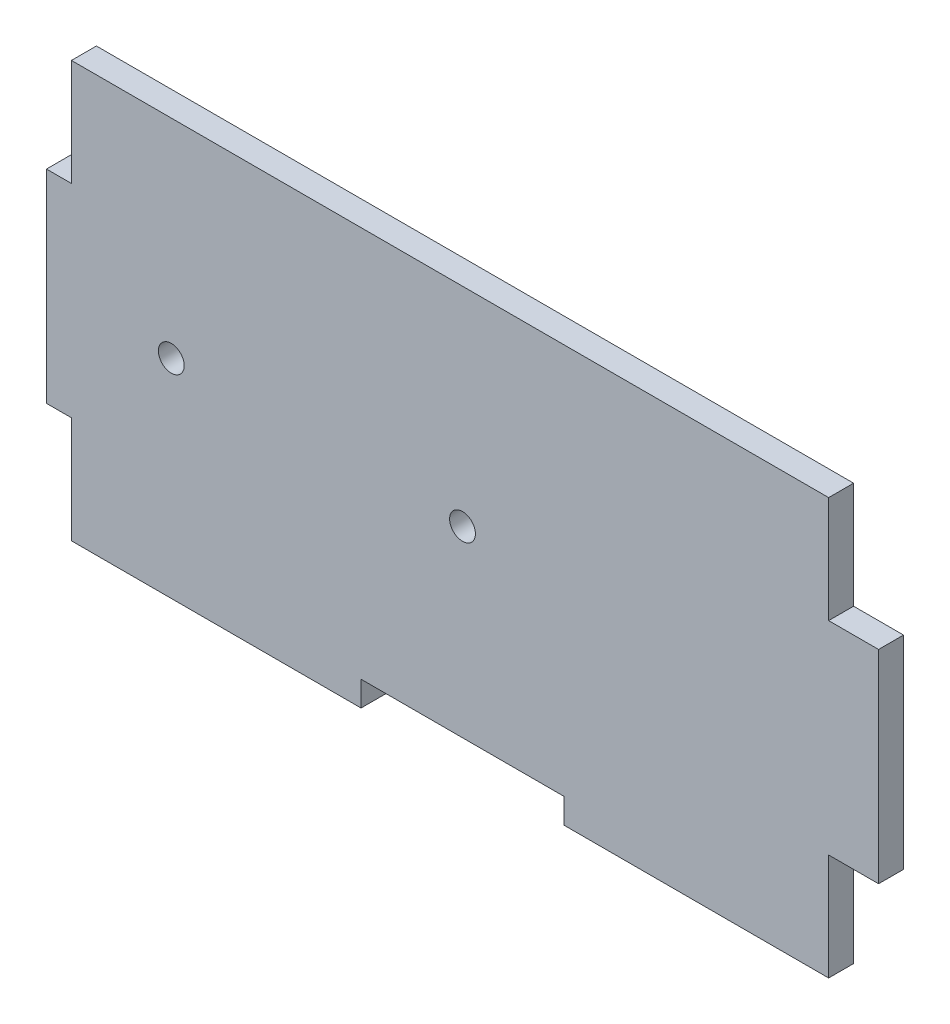
ISO-10303-21;
HEADER;
FILE_DESCRIPTION(('STEP AP214'),'2;1');
FILE_NAME('part.step','',(''),(''),'','','');
FILE_SCHEMA(('AUTOMOTIVE_DESIGN { 1 0 10303 214 1 1 1 1 }'));
ENDSEC;
DATA;
#1=APPLICATION_CONTEXT('core data for automotive mechanical design processes');
#2=APPLICATION_PROTOCOL_DEFINITION('international standard','automotive_design',2000,#1);
#3=PRODUCT_CONTEXT('',#1,'mechanical');
#4=PRODUCT('Part','Part','',(#3));
#5=PRODUCT_RELATED_PRODUCT_CATEGORY('part','',(#4));
#6=PRODUCT_DEFINITION_FORMATION('','',#4);
#7=PRODUCT_DEFINITION_CONTEXT('part definition',#1,'design');
#8=PRODUCT_DEFINITION('design','',#6,#7);
#9=PRODUCT_DEFINITION_SHAPE('','',#8);
#10=(LENGTH_UNIT() NAMED_UNIT(*) SI_UNIT(.MILLI.,.METRE.));
#11=(NAMED_UNIT(*) PLANE_ANGLE_UNIT() SI_UNIT($,.RADIAN.));
#12=(NAMED_UNIT(*) SI_UNIT($,.STERADIAN.) SOLID_ANGLE_UNIT());
#13=UNCERTAINTY_MEASURE_WITH_UNIT(LENGTH_MEASURE(1.E-05),#10,'distance_accuracy_value','');
#14=(GEOMETRIC_REPRESENTATION_CONTEXT(3) GLOBAL_UNCERTAINTY_ASSIGNED_CONTEXT((#13)) GLOBAL_UNIT_ASSIGNED_CONTEXT((#10,
#11,#12)) REPRESENTATION_CONTEXT('',''));
#15=CARTESIAN_POINT('',(0.,0.,0.));
#16=DIRECTION('',(0.,0.,1.));
#17=DIRECTION('',(1.,0.,0.));
#18=AXIS2_PLACEMENT_3D('',#15,#16,#17);
#19=CARTESIAN_POINT('',(280.,103.,3.));
#20=DIRECTION('',(0.,-1.,0.));
#21=DIRECTION('',(0.,0.,-1.));
#22=AXIS2_PLACEMENT_3D('',#19,#20,#21);
#23=PLANE('',#22);
#24=DIRECTION('',(-1.,0.,0.));
#25=VECTOR('',#24,1.);
#26=CARTESIAN_POINT('',(280.,103.,3.));
#27=LINE('',#26,#25);
#28=CARTESIAN_POINT('',(277.,103.,3.));
#29=VERTEX_POINT('',#28);
#30=CARTESIAN_POINT('',(186.,103.,3.));
#31=VERTEX_POINT('',#30);
#32=EDGE_CURVE('E160',#29,#31,#27,.T.);
#33=ORIENTED_EDGE('',*,*,#32,.F.);
#34=DIRECTION('',(0.,0.,1.));
#35=VECTOR('',#34,1.);
#36=CARTESIAN_POINT('',(277.,103.,-7.));
#37=LINE('',#36,#35);
#38=CARTESIAN_POINT('',(277.,103.,0.));
#39=VERTEX_POINT('',#38);
#40=EDGE_CURVE('E148',#39,#29,#37,.T.);
#41=ORIENTED_EDGE('',*,*,#40,.F.);
#42=DIRECTION('',(-1.,0.,0.));
#43=VECTOR('',#42,1.);
#44=CARTESIAN_POINT('',(280.,103.,0.));
#45=LINE('',#44,#43);
#46=CARTESIAN_POINT('',(186.,103.,0.));
#47=VERTEX_POINT('',#46);
#48=EDGE_CURVE('E203',#39,#47,#45,.T.);
#49=ORIENTED_EDGE('',*,*,#48,.T.);
#50=DIRECTION('',(0.,0.,-1.));
#51=VECTOR('',#50,1.);
#52=CARTESIAN_POINT('',(186.,103.,3.));
#53=LINE('',#52,#51);
#54=EDGE_CURVE('E168',#31,#47,#53,.T.);
#55=ORIENTED_EDGE('',*,*,#54,.F.);
#56=EDGE_LOOP('',(#33,#41,#49,#55));
#57=FACE_BOUND('',#56,.T.);
#58=ADVANCED_FACE('F33',(#57),#23,.F.);
#59=CARTESIAN_POINT('',(186.,103.,3.));
#60=DIRECTION('',(1.,0.,0.));
#61=DIRECTION('',(0.,0.,-1.));
#62=AXIS2_PLACEMENT_3D('',#59,#60,#61);
#63=PLANE('',#62);
#64=DIRECTION('',(0.,-1.,0.));
#65=VECTOR('',#64,1.);
#66=CARTESIAN_POINT('',(186.,103.,0.));
#67=LINE('',#66,#65);
#68=CARTESIAN_POINT('',(186.,90.195,0.));
#69=VERTEX_POINT('',#68);
#70=EDGE_CURVE('E205',#47,#69,#67,.T.);
#71=ORIENTED_EDGE('',*,*,#70,.T.);
#72=DIRECTION('',(0.,0.,-1.));
#73=VECTOR('',#72,1.);
#74=CARTESIAN_POINT('',(186.,90.195,3.));
#75=LINE('',#74,#73);
#76=CARTESIAN_POINT('',(186.,90.195,3.));
#77=VERTEX_POINT('',#76);
#78=EDGE_CURVE('E258',#77,#69,#75,.T.);
#79=ORIENTED_EDGE('',*,*,#78,.F.);
#80=DIRECTION('',(0.,-1.,0.));
#81=VECTOR('',#80,1.);
#82=CARTESIAN_POINT('',(186.,103.,3.));
#83=LINE('',#82,#81);
#84=EDGE_CURVE('E169',#31,#77,#83,.T.);
#85=ORIENTED_EDGE('',*,*,#84,.F.);
#86=ORIENTED_EDGE('',*,*,#54,.T.);
#87=EDGE_LOOP('',(#71,#79,#85,#86));
#88=FACE_BOUND('',#87,.T.);
#89=ADVANCED_FACE('F312',(#88),#63,.F.);
#90=CARTESIAN_POINT('',(186.,90.195,3.));
#91=DIRECTION('',(0.,-1.,0.));
#92=DIRECTION('',(0.,0.,-1.));
#93=AXIS2_PLACEMENT_3D('',#90,#91,#92);
#94=PLANE('',#93);
#95=DIRECTION('',(-1.,0.,0.));
#96=VECTOR('',#95,1.);
#97=CARTESIAN_POINT('',(186.,90.195,0.));
#98=LINE('',#97,#96);
#99=CARTESIAN_POINT('',(183.,90.195,0.));
#100=VERTEX_POINT('',#99);
#101=EDGE_CURVE('E208',#69,#100,#98,.T.);
#102=ORIENTED_EDGE('',*,*,#101,.T.);
#103=DIRECTION('',(0.,0.,-1.));
#104=VECTOR('',#103,1.);
#105=CARTESIAN_POINT('',(183.,90.195,3.));
#106=LINE('',#105,#104);
#107=CARTESIAN_POINT('',(183.,90.195,3.));
#108=VERTEX_POINT('',#107);
#109=EDGE_CURVE('E255',#108,#100,#106,.T.);
#110=ORIENTED_EDGE('',*,*,#109,.F.);
#111=DIRECTION('',(-1.,0.,0.));
#112=VECTOR('',#111,1.);
#113=CARTESIAN_POINT('',(186.,90.195,3.));
#114=LINE('',#113,#112);
#115=EDGE_CURVE('E171',#77,#108,#114,.T.);
#116=ORIENTED_EDGE('',*,*,#115,.F.);
#117=ORIENTED_EDGE('',*,*,#78,.T.);
#118=EDGE_LOOP('',(#102,#110,#116,#117));
#119=FACE_BOUND('',#118,.T.);
#120=ADVANCED_FACE('F308',(#119),#94,.F.);
#121=CARTESIAN_POINT('',(183.,90.195,3.));
#122=DIRECTION('',(1.,0.,0.));
#123=DIRECTION('',(0.,0.,-1.));
#124=AXIS2_PLACEMENT_3D('',#121,#122,#123);
#125=PLANE('',#124);
#126=DIRECTION('',(0.,-1.,0.));
#127=VECTOR('',#126,1.);
#128=CARTESIAN_POINT('',(183.,90.195,0.));
#129=LINE('',#128,#127);
#130=CARTESIAN_POINT('',(183.,65.805,0.));
#131=VERTEX_POINT('',#130);
#132=EDGE_CURVE('E210',#100,#131,#129,.T.);
#133=ORIENTED_EDGE('',*,*,#132,.T.);
#134=DIRECTION('',(0.,0.,-1.));
#135=VECTOR('',#134,1.);
#136=CARTESIAN_POINT('',(183.,65.805,3.));
#137=LINE('',#136,#135);
#138=CARTESIAN_POINT('',(183.,65.805,3.));
#139=VERTEX_POINT('',#138);
#140=EDGE_CURVE('E252',#139,#131,#137,.T.);
#141=ORIENTED_EDGE('',*,*,#140,.F.);
#142=DIRECTION('',(0.,-1.,0.));
#143=VECTOR('',#142,1.);
#144=CARTESIAN_POINT('',(183.,90.195,3.));
#145=LINE('',#144,#143);
#146=EDGE_CURVE('E180',#108,#139,#145,.T.);
#147=ORIENTED_EDGE('',*,*,#146,.F.);
#148=ORIENTED_EDGE('',*,*,#109,.T.);
#149=EDGE_LOOP('',(#133,#141,#147,#148));
#150=FACE_BOUND('',#149,.T.);
#151=ADVANCED_FACE('F303',(#150),#125,.F.);
#152=CARTESIAN_POINT('',(183.,65.805,3.));
#153=DIRECTION('',(0.,1.,0.));
#154=DIRECTION('',(0.,0.,1.));
#155=AXIS2_PLACEMENT_3D('',#152,#153,#154);
#156=PLANE('',#155);
#157=DIRECTION('',(1.,0.,0.));
#158=VECTOR('',#157,1.);
#159=CARTESIAN_POINT('',(183.,65.805,0.));
#160=LINE('',#159,#158);
#161=CARTESIAN_POINT('',(186.,65.805,0.));
#162=VERTEX_POINT('',#161);
#163=EDGE_CURVE('E212',#131,#162,#160,.T.);
#164=ORIENTED_EDGE('',*,*,#163,.T.);
#165=DIRECTION('',(0.,0.,-1.));
#166=VECTOR('',#165,1.);
#167=CARTESIAN_POINT('',(186.,65.805,3.));
#168=LINE('',#167,#166);
#169=CARTESIAN_POINT('',(186.,65.805,3.));
#170=VERTEX_POINT('',#169);
#171=EDGE_CURVE('E249',#170,#162,#168,.T.);
#172=ORIENTED_EDGE('',*,*,#171,.F.);
#173=DIRECTION('',(1.,0.,0.));
#174=VECTOR('',#173,1.);
#175=CARTESIAN_POINT('',(183.,65.805,3.));
#176=LINE('',#175,#174);
#177=EDGE_CURVE('E182',#139,#170,#176,.T.);
#178=ORIENTED_EDGE('',*,*,#177,.F.);
#179=ORIENTED_EDGE('',*,*,#140,.T.);
#180=EDGE_LOOP('',(#164,#172,#178,#179));
#181=FACE_BOUND('',#180,.T.);
#182=ADVANCED_FACE('F299',(#181),#156,.F.);
#183=CARTESIAN_POINT('',(186.,65.805,3.));
#184=DIRECTION('',(1.,0.,0.));
#185=DIRECTION('',(0.,0.,-1.));
#186=AXIS2_PLACEMENT_3D('',#183,#184,#185);
#187=PLANE('',#186);
#188=DIRECTION('',(0.,-1.,0.));
#189=VECTOR('',#188,1.);
#190=CARTESIAN_POINT('',(186.,65.805,0.));
#191=LINE('',#190,#189);
#192=CARTESIAN_POINT('',(186.,53.,0.));
#193=VERTEX_POINT('',#192);
#194=EDGE_CURVE('E214',#162,#193,#191,.T.);
#195=ORIENTED_EDGE('',*,*,#194,.T.);
#196=DIRECTION('',(0.,0.,-1.));
#197=VECTOR('',#196,1.);
#198=CARTESIAN_POINT('',(186.,53.,3.));
#199=LINE('',#198,#197);
#200=CARTESIAN_POINT('',(186.,53.,3.));
#201=VERTEX_POINT('',#200);
#202=EDGE_CURVE('E246',#201,#193,#199,.T.);
#203=ORIENTED_EDGE('',*,*,#202,.F.);
#204=DIRECTION('',(0.,-1.,0.));
#205=VECTOR('',#204,1.);
#206=CARTESIAN_POINT('',(186.,65.805,3.));
#207=LINE('',#206,#205);
#208=EDGE_CURVE('E184',#170,#201,#207,.T.);
#209=ORIENTED_EDGE('',*,*,#208,.F.);
#210=ORIENTED_EDGE('',*,*,#171,.T.);
#211=EDGE_LOOP('',(#195,#203,#209,#210));
#212=FACE_BOUND('',#211,.T.);
#213=ADVANCED_FACE('F294',(#212),#187,.F.);
#214=CARTESIAN_POINT('',(186.,53.,3.));
#215=DIRECTION('',(0.,1.,0.));
#216=DIRECTION('',(0.,0.,1.));
#217=AXIS2_PLACEMENT_3D('',#214,#215,#216);
#218=PLANE('',#217);
#219=DIRECTION('',(1.,0.,0.));
#220=VECTOR('',#219,1.);
#221=CARTESIAN_POINT('',(186.,53.,0.));
#222=LINE('',#221,#220);
#223=CARTESIAN_POINT('',(220.805,53.,0.));
#224=VERTEX_POINT('',#223);
#225=EDGE_CURVE('E216',#193,#224,#222,.T.);
#226=ORIENTED_EDGE('',*,*,#225,.T.);
#227=DIRECTION('',(0.,0.,-1.));
#228=VECTOR('',#227,1.);
#229=CARTESIAN_POINT('',(220.805,53.,3.));
#230=LINE('',#229,#228);
#231=CARTESIAN_POINT('',(220.805,53.,3.));
#232=VERTEX_POINT('',#231);
#233=EDGE_CURVE('E243',#232,#224,#230,.T.);
#234=ORIENTED_EDGE('',*,*,#233,.F.);
#235=DIRECTION('',(1.,0.,0.));
#236=VECTOR('',#235,1.);
#237=CARTESIAN_POINT('',(186.,53.,3.));
#238=LINE('',#237,#236);
#239=EDGE_CURVE('E186',#201,#232,#238,.T.);
#240=ORIENTED_EDGE('',*,*,#239,.F.);
#241=ORIENTED_EDGE('',*,*,#202,.T.);
#242=EDGE_LOOP('',(#226,#234,#240,#241));
#243=FACE_BOUND('',#242,.T.);
#244=ADVANCED_FACE('F288',(#243),#218,.F.);
#245=CARTESIAN_POINT('',(220.805,53.,3.));
#246=DIRECTION('',(-1.,0.,0.));
#247=DIRECTION('',(0.,0.,1.));
#248=AXIS2_PLACEMENT_3D('',#245,#246,#247);
#249=PLANE('',#248);
#250=DIRECTION('',(0.,1.,0.));
#251=VECTOR('',#250,1.);
#252=CARTESIAN_POINT('',(220.805,53.,0.));
#253=LINE('',#252,#251);
#254=CARTESIAN_POINT('',(220.805,56.,0.));
#255=VERTEX_POINT('',#254);
#256=EDGE_CURVE('E218',#224,#255,#253,.T.);
#257=ORIENTED_EDGE('',*,*,#256,.T.);
#258=DIRECTION('',(0.,0.,-1.));
#259=VECTOR('',#258,1.);
#260=CARTESIAN_POINT('',(220.805,56.,3.));
#261=LINE('',#260,#259);
#262=CARTESIAN_POINT('',(220.805,56.,3.));
#263=VERTEX_POINT('',#262);
#264=EDGE_CURVE('E240',#263,#255,#261,.T.);
#265=ORIENTED_EDGE('',*,*,#264,.F.);
#266=DIRECTION('',(0.,1.,0.));
#267=VECTOR('',#266,1.);
#268=CARTESIAN_POINT('',(220.805,53.,3.));
#269=LINE('',#268,#267);
#270=EDGE_CURVE('E188',#232,#263,#269,.T.);
#271=ORIENTED_EDGE('',*,*,#270,.F.);
#272=ORIENTED_EDGE('',*,*,#233,.T.);
#273=EDGE_LOOP('',(#257,#265,#271,#272));
#274=FACE_BOUND('',#273,.T.);
#275=ADVANCED_FACE('F284',(#274),#249,.F.);
#276=CARTESIAN_POINT('',(220.805,56.,3.));
#277=DIRECTION('',(0.,1.,0.));
#278=DIRECTION('',(0.,0.,1.));
#279=AXIS2_PLACEMENT_3D('',#276,#277,#278);
#280=PLANE('',#279);
#281=DIRECTION('',(1.,0.,0.));
#282=VECTOR('',#281,1.);
#283=CARTESIAN_POINT('',(220.805,56.,0.));
#284=LINE('',#283,#282);
#285=CARTESIAN_POINT('',(245.195,56.,0.));
#286=VERTEX_POINT('',#285);
#287=EDGE_CURVE('E220',#255,#286,#284,.T.);
#288=ORIENTED_EDGE('',*,*,#287,.T.);
#289=DIRECTION('',(0.,0.,-1.));
#290=VECTOR('',#289,1.);
#291=CARTESIAN_POINT('',(245.195,56.,3.));
#292=LINE('',#291,#290);
#293=CARTESIAN_POINT('',(245.195,56.,3.));
#294=VERTEX_POINT('',#293);
#295=EDGE_CURVE('E237',#294,#286,#292,.T.);
#296=ORIENTED_EDGE('',*,*,#295,.F.);
#297=DIRECTION('',(1.,0.,0.));
#298=VECTOR('',#297,1.);
#299=CARTESIAN_POINT('',(220.805,56.,3.));
#300=LINE('',#299,#298);
#301=EDGE_CURVE('E190',#263,#294,#300,.T.);
#302=ORIENTED_EDGE('',*,*,#301,.F.);
#303=ORIENTED_EDGE('',*,*,#264,.T.);
#304=EDGE_LOOP('',(#288,#296,#302,#303));
#305=FACE_BOUND('',#304,.T.);
#306=ADVANCED_FACE('F279',(#305),#280,.F.);
#307=CARTESIAN_POINT('',(245.195,56.,3.));
#308=DIRECTION('',(1.,0.,0.));
#309=DIRECTION('',(0.,0.,-1.));
#310=AXIS2_PLACEMENT_3D('',#307,#308,#309);
#311=PLANE('',#310);
#312=DIRECTION('',(0.,-1.,0.));
#313=VECTOR('',#312,1.);
#314=CARTESIAN_POINT('',(245.195,56.,0.));
#315=LINE('',#314,#313);
#316=CARTESIAN_POINT('',(245.195,53.,0.));
#317=VERTEX_POINT('',#316);
#318=EDGE_CURVE('E222',#286,#317,#315,.T.);
#319=ORIENTED_EDGE('',*,*,#318,.T.);
#320=DIRECTION('',(0.,0.,-1.));
#321=VECTOR('',#320,1.);
#322=CARTESIAN_POINT('',(245.195,53.,3.));
#323=LINE('',#322,#321);
#324=CARTESIAN_POINT('',(245.195,53.,3.));
#325=VERTEX_POINT('',#324);
#326=EDGE_CURVE('E234',#325,#317,#323,.T.);
#327=ORIENTED_EDGE('',*,*,#326,.F.);
#328=DIRECTION('',(0.,-1.,0.));
#329=VECTOR('',#328,1.);
#330=CARTESIAN_POINT('',(245.195,56.,3.));
#331=LINE('',#330,#329);
#332=EDGE_CURVE('E192',#294,#325,#331,.T.);
#333=ORIENTED_EDGE('',*,*,#332,.F.);
#334=ORIENTED_EDGE('',*,*,#295,.T.);
#335=EDGE_LOOP('',(#319,#327,#333,#334));
#336=FACE_BOUND('',#335,.T.);
#337=ADVANCED_FACE('F273',(#336),#311,.F.);
#338=CARTESIAN_POINT('',(269.585,53.,3.));
#339=DIRECTION('',(0.,1.,0.));
#340=DIRECTION('',(0.,0.,1.));
#341=AXIS2_PLACEMENT_3D('',#338,#339,#340);
#342=PLANE('',#341);
#343=DIRECTION('',(1.,0.,0.));
#344=VECTOR('',#343,1.);
#345=CARTESIAN_POINT('',(269.585,53.,0.));
#346=LINE('',#345,#344);
#347=CARTESIAN_POINT('',(277.,53.,0.));
#348=VERTEX_POINT('',#347);
#349=EDGE_CURVE('E225',#317,#348,#346,.T.);
#350=ORIENTED_EDGE('',*,*,#349,.T.);
#351=DIRECTION('',(0.,0.,1.));
#352=VECTOR('',#351,1.);
#353=CARTESIAN_POINT('',(277.,53.,-7.));
#354=LINE('',#353,#352);
#355=CARTESIAN_POINT('',(277.,53.,3.));
#356=VERTEX_POINT('',#355);
#357=EDGE_CURVE('E164',#348,#356,#354,.T.);
#358=ORIENTED_EDGE('',*,*,#357,.T.);
#359=DIRECTION('',(1.,0.,0.));
#360=VECTOR('',#359,1.);
#361=CARTESIAN_POINT('',(245.195,53.,3.));
#362=LINE('',#361,#360);
#363=EDGE_CURVE('E194',#325,#356,#362,.T.);
#364=ORIENTED_EDGE('',*,*,#363,.F.);
#365=ORIENTED_EDGE('',*,*,#326,.T.);
#366=EDGE_LOOP('',(#350,#358,#364,#365));
#367=FACE_BOUND('',#366,.T.);
#368=ADVANCED_FACE('F268',(#367),#342,.F.);
#369=CARTESIAN_POINT('',(280.,65.805,3.));
#370=DIRECTION('',(0.,1.,0.));
#371=DIRECTION('',(0.,0.,1.));
#372=AXIS2_PLACEMENT_3D('',#369,#370,#371);
#373=PLANE('',#372);
#374=DIRECTION('',(1.,0.,0.));
#375=VECTOR('',#374,1.);
#376=CARTESIAN_POINT('',(280.,65.805,0.));
#377=LINE('',#376,#375);
#378=CARTESIAN_POINT('',(277.,65.805,0.));
#379=VERTEX_POINT('',#378);
#380=CARTESIAN_POINT('',(283.,65.805,0.));
#381=VERTEX_POINT('',#380);
#382=EDGE_CURVE('E55',#379,#381,#377,.T.);
#383=ORIENTED_EDGE('',*,*,#382,.T.);
#384=DIRECTION('',(0.,0.,-1.));
#385=VECTOR('',#384,1.);
#386=CARTESIAN_POINT('',(283.,65.805,3.));
#387=LINE('',#386,#385);
#388=CARTESIAN_POINT('',(283.,65.805,3.));
#389=VERTEX_POINT('',#388);
#390=EDGE_CURVE('E231',#389,#381,#387,.T.);
#391=ORIENTED_EDGE('',*,*,#390,.F.);
#392=DIRECTION('',(1.,0.,0.));
#393=VECTOR('',#392,1.);
#394=CARTESIAN_POINT('',(280.,65.805,3.));
#395=LINE('',#394,#393);
#396=CARTESIAN_POINT('',(277.,65.805,3.));
#397=VERTEX_POINT('',#396);
#398=EDGE_CURVE('E197',#397,#389,#395,.T.);
#399=ORIENTED_EDGE('',*,*,#398,.F.);
#400=DIRECTION('',(0.,0.,1.));
#401=VECTOR('',#400,1.);
#402=CARTESIAN_POINT('',(277.,65.805,-7.));
#403=LINE('',#402,#401);
#404=EDGE_CURVE('E316',#379,#397,#403,.T.);
#405=ORIENTED_EDGE('',*,*,#404,.F.);
#406=EDGE_LOOP('',(#383,#391,#399,#405));
#407=FACE_BOUND('',#406,.T.);
#408=ADVANCED_FACE('F339',(#407),#373,.F.);
#409=CARTESIAN_POINT('',(283.,65.805,3.));
#410=DIRECTION('',(-1.,0.,0.));
#411=DIRECTION('',(0.,0.,1.));
#412=AXIS2_PLACEMENT_3D('',#409,#410,#411);
#413=PLANE('',#412);
#414=DIRECTION('',(0.,1.,0.));
#415=VECTOR('',#414,1.);
#416=CARTESIAN_POINT('',(283.,65.805,0.));
#417=LINE('',#416,#415);
#418=CARTESIAN_POINT('',(283.,90.195,0.));
#419=VERTEX_POINT('',#418);
#420=EDGE_CURVE('E173',#381,#419,#417,.T.);
#421=ORIENTED_EDGE('',*,*,#420,.T.);
#422=DIRECTION('',(0.,0.,-1.));
#423=VECTOR('',#422,1.);
#424=CARTESIAN_POINT('',(283.,90.195,3.));
#425=LINE('',#424,#423);
#426=CARTESIAN_POINT('',(283.,90.195,3.));
#427=VERTEX_POINT('',#426);
#428=EDGE_CURVE('E202',#427,#419,#425,.T.);
#429=ORIENTED_EDGE('',*,*,#428,.F.);
#430=DIRECTION('',(0.,1.,0.));
#431=VECTOR('',#430,1.);
#432=CARTESIAN_POINT('',(283.,65.805,3.));
#433=LINE('',#432,#431);
#434=EDGE_CURVE('E199',#389,#427,#433,.T.);
#435=ORIENTED_EDGE('',*,*,#434,.F.);
#436=ORIENTED_EDGE('',*,*,#390,.T.);
#437=EDGE_LOOP('',(#421,#429,#435,#436));
#438=FACE_BOUND('',#437,.T.);
#439=ADVANCED_FACE('F336',(#438),#413,.F.);
#440=CARTESIAN_POINT('',(283.,90.195,3.));
#441=DIRECTION('',(0.,-1.,0.));
#442=DIRECTION('',(0.,0.,-1.));
#443=AXIS2_PLACEMENT_3D('',#440,#441,#442);
#444=PLANE('',#443);
#445=DIRECTION('',(-1.,0.,0.));
#446=VECTOR('',#445,1.);
#447=CARTESIAN_POINT('',(283.,90.195,0.));
#448=LINE('',#447,#446);
#449=CARTESIAN_POINT('',(277.,90.195,0.));
#450=VERTEX_POINT('',#449);
#451=EDGE_CURVE('E47',#419,#450,#448,.T.);
#452=ORIENTED_EDGE('',*,*,#451,.T.);
#453=DIRECTION('',(0.,0.,1.));
#454=VECTOR('',#453,1.);
#455=CARTESIAN_POINT('',(277.,90.195,-7.));
#456=LINE('',#455,#454);
#457=CARTESIAN_POINT('',(277.,90.195,3.));
#458=VERTEX_POINT('',#457);
#459=EDGE_CURVE('E155',#450,#458,#456,.T.);
#460=ORIENTED_EDGE('',*,*,#459,.T.);
#461=DIRECTION('',(-1.,0.,0.));
#462=VECTOR('',#461,1.);
#463=CARTESIAN_POINT('',(283.,90.195,3.));
#464=LINE('',#463,#462);
#465=EDGE_CURVE('E163',#427,#458,#464,.T.);
#466=ORIENTED_EDGE('',*,*,#465,.F.);
#467=ORIENTED_EDGE('',*,*,#428,.T.);
#468=EDGE_LOOP('',(#452,#460,#466,#467));
#469=FACE_BOUND('',#468,.T.);
#470=ADVANCED_FACE('F333',(#469),#444,.F.);
#471=CARTESIAN_POINT('',(0.,0.,3.));
#472=DIRECTION('',(0.,0.,1.));
#473=DIRECTION('',(1.,0.,0.));
#474=AXIS2_PLACEMENT_3D('',#471,#472,#473);
#475=PLANE('',#474);
#476=ORIENTED_EDGE('',*,*,#465,.T.);
#477=DIRECTION('',(0.,-1.,0.));
#478=VECTOR('',#477,1.);
#479=CARTESIAN_POINT('',(277.,90.195,3.));
#480=LINE('',#479,#478);
#481=EDGE_CURVE('E151',#29,#458,#480,.T.);
#482=ORIENTED_EDGE('',*,*,#481,.F.);
#483=ORIENTED_EDGE('',*,*,#32,.T.);
#484=ORIENTED_EDGE('',*,*,#84,.T.);
#485=ORIENTED_EDGE('',*,*,#115,.T.);
#486=ORIENTED_EDGE('',*,*,#146,.T.);
#487=ORIENTED_EDGE('',*,*,#177,.T.);
#488=ORIENTED_EDGE('',*,*,#208,.T.);
#489=ORIENTED_EDGE('',*,*,#239,.T.);
#490=ORIENTED_EDGE('',*,*,#270,.T.);
#491=ORIENTED_EDGE('',*,*,#301,.T.);
#492=ORIENTED_EDGE('',*,*,#332,.T.);
#493=ORIENTED_EDGE('',*,*,#363,.T.);
#494=DIRECTION('',(0.,-1.,0.));
#495=VECTOR('',#494,1.);
#496=CARTESIAN_POINT('',(277.,65.805,3.));
#497=LINE('',#496,#495);
#498=EDGE_CURVE('E314',#397,#356,#497,.T.);
#499=ORIENTED_EDGE('',*,*,#498,.F.);
#500=ORIENTED_EDGE('',*,*,#398,.T.);
#501=ORIENTED_EDGE('',*,*,#434,.T.);
#502=EDGE_LOOP('',(#476,#482,#483,#484,#485,#486,#487,#488,#489,#490,#491,#492,#493,#499,#500,#501));
#503=FACE_BOUND('',#502,.T.);
#504=CARTESIAN_POINT('',(233.,78.,3.));
#505=DIRECTION('',(0.,0.,1.));
#506=DIRECTION('',(1.,0.,0.));
#507=AXIS2_PLACEMENT_3D('',#504,#505,#506);
#508=CIRCLE('',#507,1.54999999999999);
#509=CARTESIAN_POINT('',(234.55,78.,3.));
#510=VERTEX_POINT('',#509);
#511=EDGE_CURVE('E324',#510,#510,#508,.T.);
#512=ORIENTED_EDGE('',*,*,#511,.F.);
#513=EDGE_LOOP('',(#512));
#514=FACE_BOUND('',#513,.T.);
#515=CARTESIAN_POINT('',(198.,78.,3.));
#516=DIRECTION('',(0.,0.,1.));
#517=DIRECTION('',(1.,0.,0.));
#518=AXIS2_PLACEMENT_3D('',#515,#516,#517);
#519=CIRCLE('',#518,1.54999999999999);
#520=CARTESIAN_POINT('',(199.55,78.,3.));
#521=VERTEX_POINT('',#520);
#522=EDGE_CURVE('E176',#521,#521,#519,.T.);
#523=ORIENTED_EDGE('',*,*,#522,.F.);
#524=EDGE_LOOP('',(#523));
#525=FACE_BOUND('',#524,.T.);
#526=ADVANCED_FACE('F158',(#503,#514,#525),#475,.T.);
#527=CARTESIAN_POINT('',(0.,0.,0.));
#528=DIRECTION('',(0.,0.,1.));
#529=DIRECTION('',(1.,0.,0.));
#530=AXIS2_PLACEMENT_3D('',#527,#528,#529);
#531=PLANE('',#530);
#532=CARTESIAN_POINT('',(233.,78.,0.));
#533=DIRECTION('',(0.,0.,1.));
#534=DIRECTION('',(1.,0.,0.));
#535=AXIS2_PLACEMENT_3D('',#532,#533,#534);
#536=CIRCLE('',#535,1.54999999999999);
#537=CARTESIAN_POINT('',(234.55,78.,0.));
#538=VERTEX_POINT('',#537);
#539=EDGE_CURVE('E206',#538,#538,#536,.T.);
#540=ORIENTED_EDGE('',*,*,#539,.T.);
#541=EDGE_LOOP('',(#540));
#542=FACE_BOUND('',#541,.T.);
#543=CARTESIAN_POINT('',(198.,78.,0.));
#544=DIRECTION('',(0.,0.,1.));
#545=DIRECTION('',(1.,0.,0.));
#546=AXIS2_PLACEMENT_3D('',#543,#544,#545);
#547=CIRCLE('',#546,1.54999999999999);
#548=CARTESIAN_POINT('',(199.55,78.,0.));
#549=VERTEX_POINT('',#548);
#550=EDGE_CURVE('E326',#549,#549,#547,.T.);
#551=ORIENTED_EDGE('',*,*,#550,.T.);
#552=EDGE_LOOP('',(#551));
#553=FACE_BOUND('',#552,.T.);
#554=DIRECTION('',(0.,-1.,0.));
#555=VECTOR('',#554,1.);
#556=CARTESIAN_POINT('',(277.,0.,0.));
#557=LINE('',#556,#555);
#558=EDGE_CURVE('E11',#39,#450,#557,.T.);
#559=ORIENTED_EDGE('',*,*,#558,.T.);
#560=ORIENTED_EDGE('',*,*,#451,.F.);
#561=ORIENTED_EDGE('',*,*,#420,.F.);
#562=ORIENTED_EDGE('',*,*,#382,.F.);
#563=DIRECTION('',(0.,-1.,0.));
#564=VECTOR('',#563,1.);
#565=CARTESIAN_POINT('',(277.,0.,0.));
#566=LINE('',#565,#564);
#567=EDGE_CURVE('E40',#379,#348,#566,.T.);
#568=ORIENTED_EDGE('',*,*,#567,.T.);
#569=ORIENTED_EDGE('',*,*,#349,.F.);
#570=ORIENTED_EDGE('',*,*,#318,.F.);
#571=ORIENTED_EDGE('',*,*,#287,.F.);
#572=ORIENTED_EDGE('',*,*,#256,.F.);
#573=ORIENTED_EDGE('',*,*,#225,.F.);
#574=ORIENTED_EDGE('',*,*,#194,.F.);
#575=ORIENTED_EDGE('',*,*,#163,.F.);
#576=ORIENTED_EDGE('',*,*,#132,.F.);
#577=ORIENTED_EDGE('',*,*,#101,.F.);
#578=ORIENTED_EDGE('',*,*,#70,.F.);
#579=ORIENTED_EDGE('',*,*,#48,.F.);
#580=EDGE_LOOP('',(#559,#560,#561,#562,#568,#569,#570,#571,#572,#573,#574,#575,#576,#577,#578,#579));
#581=FACE_BOUND('',#580,.T.);
#582=ADVANCED_FACE('F262',(#542,#553,#581),#531,.F.);
#583=CARTESIAN_POINT('',(198.,78.,0.));
#584=DIRECTION('',(0.,0.,1.));
#585=DIRECTION('',(1.,0.,0.));
#586=AXIS2_PLACEMENT_3D('',#583,#584,#585);
#587=CYLINDRICAL_SURFACE('',#586,1.54999999999999);
#588=ORIENTED_EDGE('',*,*,#550,.F.);
#589=EDGE_LOOP('',(#588));
#590=FACE_BOUND('',#589,.T.);
#591=ORIENTED_EDGE('',*,*,#522,.T.);
#592=EDGE_LOOP('',(#591));
#593=FACE_BOUND('',#592,.T.);
#594=ADVANCED_FACE('F350',(#590,#593),#587,.F.);
#595=CARTESIAN_POINT('',(233.,78.,0.));
#596=DIRECTION('',(0.,0.,1.));
#597=DIRECTION('',(1.,0.,0.));
#598=AXIS2_PLACEMENT_3D('',#595,#596,#597);
#599=CYLINDRICAL_SURFACE('',#598,1.54999999999999);
#600=ORIENTED_EDGE('',*,*,#539,.F.);
#601=EDGE_LOOP('',(#600));
#602=FACE_BOUND('',#601,.T.);
#603=ORIENTED_EDGE('',*,*,#511,.T.);
#604=EDGE_LOOP('',(#603));
#605=FACE_BOUND('',#604,.T.);
#606=ADVANCED_FACE('F342',(#602,#605),#599,.F.);
#607=CARTESIAN_POINT('',(277.,65.805,-7.));
#608=DIRECTION('',(-1.,0.,0.));
#609=DIRECTION('',(0.,0.,1.));
#610=AXIS2_PLACEMENT_3D('',#607,#608,#609);
#611=PLANE('',#610);
#612=ORIENTED_EDGE('',*,*,#404,.T.);
#613=ORIENTED_EDGE('',*,*,#498,.T.);
#614=ORIENTED_EDGE('',*,*,#357,.F.);
#615=ORIENTED_EDGE('',*,*,#567,.F.);
#616=EDGE_LOOP('',(#612,#613,#614,#615));
#617=FACE_BOUND('',#616,.T.);
#618=ADVANCED_FACE('F340',(#617),#611,.F.);
#619=CARTESIAN_POINT('',(277.,90.195,-7.));
#620=DIRECTION('',(-1.,0.,0.));
#621=DIRECTION('',(0.,0.,1.));
#622=AXIS2_PLACEMENT_3D('',#619,#620,#621);
#623=PLANE('',#622);
#624=ORIENTED_EDGE('',*,*,#40,.T.);
#625=ORIENTED_EDGE('',*,*,#481,.T.);
#626=ORIENTED_EDGE('',*,*,#459,.F.);
#627=ORIENTED_EDGE('',*,*,#558,.F.);
#628=EDGE_LOOP('',(#624,#625,#626,#627));
#629=FACE_BOUND('',#628,.T.);
#630=ADVANCED_FACE('F150',(#629),#623,.F.);
#631=CLOSED_SHELL('',(#58,#89,#120,#151,#182,#213,#244,#275,#306,#337,#368,#408,#439,#470,#526,
#582,#594,#606,#618,#630));
#632=MANIFOLD_SOLID_BREP('B2',#631);
#633=ADVANCED_BREP_SHAPE_REPRESENTATION('',(#18,#632),#14);
#634=SHAPE_DEFINITION_REPRESENTATION(#9,#633);
ENDSEC;
END-ISO-10303-21;
